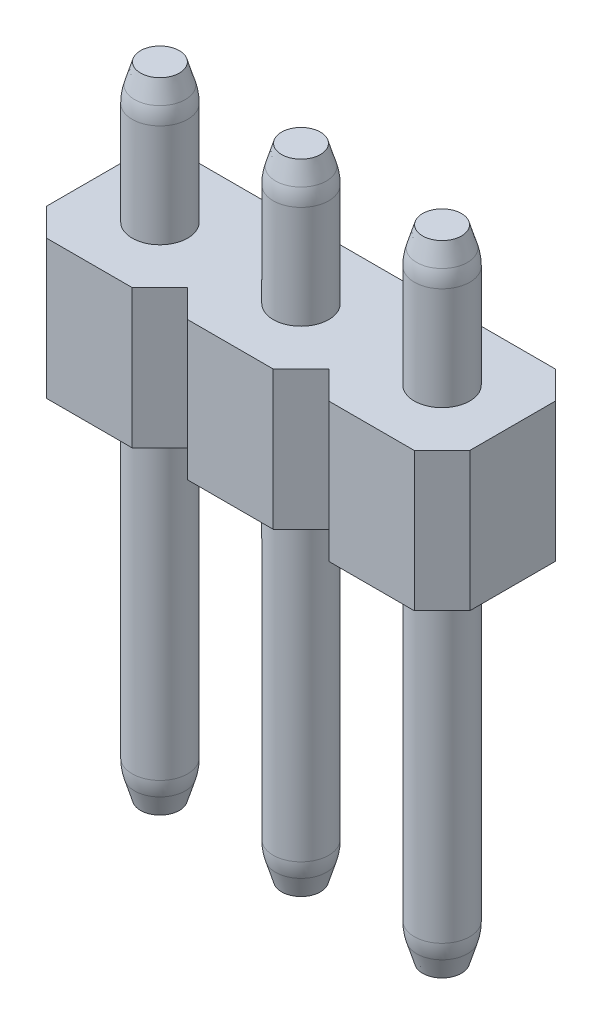
ISO-10303-21;
HEADER;
FILE_DESCRIPTION(('STEP AP214'),'2;1');
FILE_NAME('part.step','',(''),(''),'','','');
FILE_SCHEMA(('AUTOMOTIVE_DESIGN { 1 0 10303 214 1 1 1 1 }'));
ENDSEC;
DATA;
#1=APPLICATION_CONTEXT('core data for automotive mechanical design processes');
#2=APPLICATION_PROTOCOL_DEFINITION('international standard','automotive_design',2000,#1);
#3=PRODUCT_CONTEXT('',#1,'mechanical');
#4=PRODUCT('Part','Part','',(#3));
#5=PRODUCT_RELATED_PRODUCT_CATEGORY('part','',(#4));
#6=PRODUCT_DEFINITION_FORMATION('','',#4);
#7=PRODUCT_DEFINITION_CONTEXT('part definition',#1,'design');
#8=PRODUCT_DEFINITION('design','',#6,#7);
#9=PRODUCT_DEFINITION_SHAPE('','',#8);
#10=(LENGTH_UNIT() NAMED_UNIT(*) SI_UNIT(.MILLI.,.METRE.));
#11=(NAMED_UNIT(*) PLANE_ANGLE_UNIT() SI_UNIT($,.RADIAN.));
#12=(NAMED_UNIT(*) SI_UNIT($,.STERADIAN.) SOLID_ANGLE_UNIT());
#13=UNCERTAINTY_MEASURE_WITH_UNIT(LENGTH_MEASURE(1.E-05),#10,'distance_accuracy_value','');
#14=(GEOMETRIC_REPRESENTATION_CONTEXT(3) GLOBAL_UNCERTAINTY_ASSIGNED_CONTEXT((#13)) GLOBAL_UNIT_ASSIGNED_CONTEXT((#10,
#11,#12)) REPRESENTATION_CONTEXT('',''));
#15=CARTESIAN_POINT('',(0.,0.,0.));
#16=DIRECTION('',(0.,0.,1.));
#17=DIRECTION('',(1.,0.,0.));
#18=AXIS2_PLACEMENT_3D('',#15,#16,#17);
#19=CARTESIAN_POINT('',(24.13,9.,0.77));
#20=DIRECTION('',(0.707106781186547,0.,-0.707106781186548));
#21=DIRECTION('',(-0.707106781186548,0.,-0.707106781186547));
#22=AXIS2_PLACEMENT_3D('',#19,#20,#21);
#23=PLANE('',#22);
#24=DIRECTION('',(0.707106781186548,0.,0.707106781186547));
#25=VECTOR('',#24,1.);
#26=CARTESIAN_POINT('',(24.13,6.5,0.77));
#27=LINE('',#26,#25);
#28=CARTESIAN_POINT('',(24.13,6.5,0.77));
#29=VERTEX_POINT('',#28);
#30=CARTESIAN_POINT('',(24.63,6.5,1.27));
#31=VERTEX_POINT('',#30);
#32=EDGE_CURVE('E200',#29,#31,#27,.T.);
#33=ORIENTED_EDGE('',*,*,#32,.T.);
#34=DIRECTION('',(0.,-1.,0.));
#35=VECTOR('',#34,1.);
#36=CARTESIAN_POINT('',(24.63,9.,1.27));
#37=LINE('',#36,#35);
#38=CARTESIAN_POINT('',(24.63,9.,1.27));
#39=VERTEX_POINT('',#38);
#40=EDGE_CURVE('E280',#39,#31,#37,.T.);
#41=ORIENTED_EDGE('',*,*,#40,.F.);
#42=DIRECTION('',(0.707106781186548,0.,0.707106781186547));
#43=VECTOR('',#42,1.);
#44=CARTESIAN_POINT('',(24.13,9.,0.77));
#45=LINE('',#44,#43);
#46=CARTESIAN_POINT('',(24.13,9.,0.77));
#47=VERTEX_POINT('',#46);
#48=EDGE_CURVE('E131',#47,#39,#45,.T.);
#49=ORIENTED_EDGE('',*,*,#48,.F.);
#50=DIRECTION('',(0.,-1.,0.));
#51=VECTOR('',#50,1.);
#52=CARTESIAN_POINT('',(24.13,9.,0.77));
#53=LINE('',#52,#51);
#54=EDGE_CURVE('E283',#47,#29,#53,.T.);
#55=ORIENTED_EDGE('',*,*,#54,.T.);
#56=EDGE_LOOP('',(#33,#41,#49,#55));
#57=FACE_BOUND('',#56,.T.);
#58=ADVANCED_FACE('F40',(#57),#23,.F.);
#59=CARTESIAN_POINT('',(24.63,9.,1.27));
#60=DIRECTION('',(0.,0.,-1.));
#61=DIRECTION('',(-1.,0.,0.));
#62=AXIS2_PLACEMENT_3D('',#59,#60,#61);
#63=PLANE('',#62);
#64=DIRECTION('',(1.,0.,0.));
#65=VECTOR('',#64,1.);
#66=CARTESIAN_POINT('',(24.63,6.5,1.27));
#67=LINE('',#66,#65);
#68=CARTESIAN_POINT('',(26.17,6.5,1.27));
#69=VERTEX_POINT('',#68);
#70=EDGE_CURVE('E202',#31,#69,#67,.T.);
#71=ORIENTED_EDGE('',*,*,#70,.T.);
#72=DIRECTION('',(0.,-1.,0.));
#73=VECTOR('',#72,1.);
#74=CARTESIAN_POINT('',(26.17,9.,1.27));
#75=LINE('',#74,#73);
#76=CARTESIAN_POINT('',(26.17,9.,1.27));
#77=VERTEX_POINT('',#76);
#78=EDGE_CURVE('E277',#77,#69,#75,.T.);
#79=ORIENTED_EDGE('',*,*,#78,.F.);
#80=DIRECTION('',(1.,0.,0.));
#81=VECTOR('',#80,1.);
#82=CARTESIAN_POINT('',(24.63,9.,1.27));
#83=LINE('',#82,#81);
#84=EDGE_CURVE('E407',#39,#77,#83,.T.);
#85=ORIENTED_EDGE('',*,*,#84,.F.);
#86=ORIENTED_EDGE('',*,*,#40,.T.);
#87=EDGE_LOOP('',(#71,#79,#85,#86));
#88=FACE_BOUND('',#87,.T.);
#89=ADVANCED_FACE('F430',(#88),#63,.F.);
#90=CARTESIAN_POINT('',(26.17,9.,1.27));
#91=DIRECTION('',(-0.707106781186547,0.,-0.707106781186548));
#92=DIRECTION('',(-0.707106781186548,0.,0.707106781186547));
#93=AXIS2_PLACEMENT_3D('',#90,#91,#92);
#94=PLANE('',#93);
#95=DIRECTION('',(0.707106781186548,0.,-0.707106781186547));
#96=VECTOR('',#95,1.);
#97=CARTESIAN_POINT('',(26.17,6.5,1.27));
#98=LINE('',#97,#96);
#99=CARTESIAN_POINT('',(26.67,6.5,0.77));
#100=VERTEX_POINT('',#99);
#101=EDGE_CURVE('E205',#69,#100,#98,.T.);
#102=ORIENTED_EDGE('',*,*,#101,.T.);
#103=DIRECTION('',(0.,-1.,0.));
#104=VECTOR('',#103,1.);
#105=CARTESIAN_POINT('',(26.67,9.,0.77));
#106=LINE('',#105,#104);
#107=CARTESIAN_POINT('',(26.67,9.,0.77));
#108=VERTEX_POINT('',#107);
#109=EDGE_CURVE('E274',#108,#100,#106,.T.);
#110=ORIENTED_EDGE('',*,*,#109,.F.);
#111=DIRECTION('',(0.707106781186548,0.,-0.707106781186547));
#112=VECTOR('',#111,1.);
#113=CARTESIAN_POINT('',(26.17,9.,1.27));
#114=LINE('',#113,#112);
#115=EDGE_CURVE('E405',#77,#108,#114,.T.);
#116=ORIENTED_EDGE('',*,*,#115,.F.);
#117=ORIENTED_EDGE('',*,*,#78,.T.);
#118=EDGE_LOOP('',(#102,#110,#116,#117));
#119=FACE_BOUND('',#118,.T.);
#120=ADVANCED_FACE('F436',(#119),#94,.F.);
#121=CARTESIAN_POINT('',(26.67,9.,0.77));
#122=DIRECTION('',(0.707106781186547,0.,-0.707106781186548));
#123=DIRECTION('',(-0.707106781186548,0.,-0.707106781186547));
#124=AXIS2_PLACEMENT_3D('',#121,#122,#123);
#125=PLANE('',#124);
#126=DIRECTION('',(0.707106781186548,0.,0.707106781186547));
#127=VECTOR('',#126,1.);
#128=CARTESIAN_POINT('',(26.67,6.5,0.77));
#129=LINE('',#128,#127);
#130=CARTESIAN_POINT('',(27.17,6.5,1.27));
#131=VERTEX_POINT('',#130);
#132=EDGE_CURVE('E207',#100,#131,#129,.T.);
#133=ORIENTED_EDGE('',*,*,#132,.T.);
#134=DIRECTION('',(0.,-1.,0.));
#135=VECTOR('',#134,1.);
#136=CARTESIAN_POINT('',(27.17,9.,1.27));
#137=LINE('',#136,#135);
#138=CARTESIAN_POINT('',(27.17,9.,1.27));
#139=VERTEX_POINT('',#138);
#140=EDGE_CURVE('E271',#139,#131,#137,.T.);
#141=ORIENTED_EDGE('',*,*,#140,.F.);
#142=DIRECTION('',(0.707106781186548,0.,0.707106781186547));
#143=VECTOR('',#142,1.);
#144=CARTESIAN_POINT('',(26.67,9.,0.77));
#145=LINE('',#144,#143);
#146=EDGE_CURVE('E403',#108,#139,#145,.T.);
#147=ORIENTED_EDGE('',*,*,#146,.F.);
#148=ORIENTED_EDGE('',*,*,#109,.T.);
#149=EDGE_LOOP('',(#133,#141,#147,#148));
#150=FACE_BOUND('',#149,.T.);
#151=ADVANCED_FACE('F440',(#150),#125,.F.);
#152=CARTESIAN_POINT('',(27.17,9.,1.27));
#153=DIRECTION('',(0.,0.,-1.));
#154=DIRECTION('',(-1.,0.,0.));
#155=AXIS2_PLACEMENT_3D('',#152,#153,#154);
#156=PLANE('',#155);
#157=DIRECTION('',(1.,0.,0.));
#158=VECTOR('',#157,1.);
#159=CARTESIAN_POINT('',(27.17,6.5,1.27));
#160=LINE('',#159,#158);
#161=CARTESIAN_POINT('',(28.71,6.5,1.27));
#162=VERTEX_POINT('',#161);
#163=EDGE_CURVE('E209',#131,#162,#160,.T.);
#164=ORIENTED_EDGE('',*,*,#163,.T.);
#165=DIRECTION('',(0.,-1.,0.));
#166=VECTOR('',#165,1.);
#167=CARTESIAN_POINT('',(28.71,9.,1.27));
#168=LINE('',#167,#166);
#169=CARTESIAN_POINT('',(28.71,9.,1.27));
#170=VERTEX_POINT('',#169);
#171=EDGE_CURVE('E268',#170,#162,#168,.T.);
#172=ORIENTED_EDGE('',*,*,#171,.F.);
#173=DIRECTION('',(1.,0.,0.));
#174=VECTOR('',#173,1.);
#175=CARTESIAN_POINT('',(27.17,9.,1.27));
#176=LINE('',#175,#174);
#177=EDGE_CURVE('E401',#139,#170,#176,.T.);
#178=ORIENTED_EDGE('',*,*,#177,.F.);
#179=ORIENTED_EDGE('',*,*,#140,.T.);
#180=EDGE_LOOP('',(#164,#172,#178,#179));
#181=FACE_BOUND('',#180,.T.);
#182=ADVANCED_FACE('F445',(#181),#156,.F.);
#183=CARTESIAN_POINT('',(28.71,9.,1.27));
#184=DIRECTION('',(-0.707106781186547,0.,-0.707106781186548));
#185=DIRECTION('',(-0.707106781186548,0.,0.707106781186547));
#186=AXIS2_PLACEMENT_3D('',#183,#184,#185);
#187=PLANE('',#186);
#188=DIRECTION('',(0.707106781186548,0.,-0.707106781186547));
#189=VECTOR('',#188,1.);
#190=CARTESIAN_POINT('',(28.71,6.5,1.27));
#191=LINE('',#190,#189);
#192=CARTESIAN_POINT('',(29.21,6.5,0.77));
#193=VERTEX_POINT('',#192);
#194=EDGE_CURVE('E211',#162,#193,#191,.T.);
#195=ORIENTED_EDGE('',*,*,#194,.T.);
#196=DIRECTION('',(0.,-1.,0.));
#197=VECTOR('',#196,1.);
#198=CARTESIAN_POINT('',(29.21,9.,0.77));
#199=LINE('',#198,#197);
#200=CARTESIAN_POINT('',(29.21,9.,0.77));
#201=VERTEX_POINT('',#200);
#202=EDGE_CURVE('E265',#201,#193,#199,.T.);
#203=ORIENTED_EDGE('',*,*,#202,.F.);
#204=DIRECTION('',(0.707106781186548,0.,-0.707106781186547));
#205=VECTOR('',#204,1.);
#206=CARTESIAN_POINT('',(28.71,9.,1.27));
#207=LINE('',#206,#205);
#208=EDGE_CURVE('E399',#170,#201,#207,.T.);
#209=ORIENTED_EDGE('',*,*,#208,.F.);
#210=ORIENTED_EDGE('',*,*,#171,.T.);
#211=EDGE_LOOP('',(#195,#203,#209,#210));
#212=FACE_BOUND('',#211,.T.);
#213=ADVANCED_FACE('F451',(#212),#187,.F.);
#214=CARTESIAN_POINT('',(29.21,9.,0.77));
#215=DIRECTION('',(0.70710678118655,0.,-0.707106781186545));
#216=DIRECTION('',(-0.707106781186545,0.,-0.70710678118655));
#217=AXIS2_PLACEMENT_3D('',#214,#215,#216);
#218=PLANE('',#217);
#219=DIRECTION('',(0.707106781186545,0.,0.70710678118655));
#220=VECTOR('',#219,1.);
#221=CARTESIAN_POINT('',(29.21,6.5,0.77));
#222=LINE('',#221,#220);
#223=CARTESIAN_POINT('',(29.71,6.5,1.27));
#224=VERTEX_POINT('',#223);
#225=EDGE_CURVE('E213',#193,#224,#222,.T.);
#226=ORIENTED_EDGE('',*,*,#225,.T.);
#227=DIRECTION('',(0.,-1.,0.));
#228=VECTOR('',#227,1.);
#229=CARTESIAN_POINT('',(29.71,9.,1.27));
#230=LINE('',#229,#228);
#231=CARTESIAN_POINT('',(29.71,9.,1.27));
#232=VERTEX_POINT('',#231);
#233=EDGE_CURVE('E262',#232,#224,#230,.T.);
#234=ORIENTED_EDGE('',*,*,#233,.F.);
#235=DIRECTION('',(0.707106781186545,0.,0.70710678118655));
#236=VECTOR('',#235,1.);
#237=CARTESIAN_POINT('',(29.21,9.,0.77));
#238=LINE('',#237,#236);
#239=EDGE_CURVE('E397',#201,#232,#238,.T.);
#240=ORIENTED_EDGE('',*,*,#239,.F.);
#241=ORIENTED_EDGE('',*,*,#202,.T.);
#242=EDGE_LOOP('',(#226,#234,#240,#241));
#243=FACE_BOUND('',#242,.T.);
#244=ADVANCED_FACE('F455',(#243),#218,.F.);
#245=CARTESIAN_POINT('',(29.71,9.,1.27));
#246=DIRECTION('',(0.,0.,-1.));
#247=DIRECTION('',(-1.,0.,0.));
#248=AXIS2_PLACEMENT_3D('',#245,#246,#247);
#249=PLANE('',#248);
#250=DIRECTION('',(1.,0.,0.));
#251=VECTOR('',#250,1.);
#252=CARTESIAN_POINT('',(29.71,6.5,1.27));
#253=LINE('',#252,#251);
#254=CARTESIAN_POINT('',(31.25,6.5,1.27));
#255=VERTEX_POINT('',#254);
#256=EDGE_CURVE('E215',#224,#255,#253,.T.);
#257=ORIENTED_EDGE('',*,*,#256,.T.);
#258=DIRECTION('',(0.,-1.,0.));
#259=VECTOR('',#258,1.);
#260=CARTESIAN_POINT('',(31.25,9.,1.27));
#261=LINE('',#260,#259);
#262=CARTESIAN_POINT('',(31.25,9.,1.27));
#263=VERTEX_POINT('',#262);
#264=EDGE_CURVE('E259',#263,#255,#261,.T.);
#265=ORIENTED_EDGE('',*,*,#264,.F.);
#266=DIRECTION('',(1.,0.,0.));
#267=VECTOR('',#266,1.);
#268=CARTESIAN_POINT('',(29.71,9.,1.27));
#269=LINE('',#268,#267);
#270=EDGE_CURVE('E395',#232,#263,#269,.T.);
#271=ORIENTED_EDGE('',*,*,#270,.F.);
#272=ORIENTED_EDGE('',*,*,#233,.T.);
#273=EDGE_LOOP('',(#257,#265,#271,#272));
#274=FACE_BOUND('',#273,.T.);
#275=ADVANCED_FACE('F460',(#274),#249,.F.);
#276=CARTESIAN_POINT('',(31.25,9.,1.27));
#277=DIRECTION('',(-0.707106781186547,0.,-0.707106781186548));
#278=DIRECTION('',(-0.707106781186548,0.,0.707106781186547));
#279=AXIS2_PLACEMENT_3D('',#276,#277,#278);
#280=PLANE('',#279);
#281=DIRECTION('',(0.707106781186548,0.,-0.707106781186547));
#282=VECTOR('',#281,1.);
#283=CARTESIAN_POINT('',(31.25,6.5,1.27));
#284=LINE('',#283,#282);
#285=CARTESIAN_POINT('',(31.75,6.5,0.77));
#286=VERTEX_POINT('',#285);
#287=EDGE_CURVE('E217',#255,#286,#284,.T.);
#288=ORIENTED_EDGE('',*,*,#287,.T.);
#289=DIRECTION('',(0.,-1.,0.));
#290=VECTOR('',#289,1.);
#291=CARTESIAN_POINT('',(31.75,9.,0.77));
#292=LINE('',#291,#290);
#293=CARTESIAN_POINT('',(31.75,9.,0.77));
#294=VERTEX_POINT('',#293);
#295=EDGE_CURVE('E257',#294,#286,#292,.T.);
#296=ORIENTED_EDGE('',*,*,#295,.F.);
#297=DIRECTION('',(0.707106781186548,0.,-0.707106781186547));
#298=VECTOR('',#297,1.);
#299=CARTESIAN_POINT('',(31.25,9.,1.27));
#300=LINE('',#299,#298);
#301=EDGE_CURVE('E392',#263,#294,#300,.T.);
#302=ORIENTED_EDGE('',*,*,#301,.F.);
#303=ORIENTED_EDGE('',*,*,#264,.T.);
#304=EDGE_LOOP('',(#288,#296,#302,#303));
#305=FACE_BOUND('',#304,.T.);
#306=ADVANCED_FACE('F463',(#305),#280,.F.);
#307=CARTESIAN_POINT('',(31.25,9.,-1.27));
#308=DIRECTION('',(-0.707106781186547,0.,0.707106781186548));
#309=DIRECTION('',(0.707106781186548,0.,0.707106781186547));
#310=AXIS2_PLACEMENT_3D('',#307,#308,#309);
#311=PLANE('',#310);
#312=DIRECTION('',(-0.707106781186548,0.,-0.707106781186547));
#313=VECTOR('',#312,1.);
#314=CARTESIAN_POINT('',(31.25,6.5,-1.27));
#315=LINE('',#314,#313);
#316=CARTESIAN_POINT('',(31.75,6.5,-0.77));
#317=VERTEX_POINT('',#316);
#318=CARTESIAN_POINT('',(31.25,6.5,-1.27));
#319=VERTEX_POINT('',#318);
#320=EDGE_CURVE('E220',#317,#319,#315,.T.);
#321=ORIENTED_EDGE('',*,*,#320,.T.);
#322=DIRECTION('',(0.,-1.,0.));
#323=VECTOR('',#322,1.);
#324=CARTESIAN_POINT('',(31.25,9.,-1.27));
#325=LINE('',#324,#323);
#326=CARTESIAN_POINT('',(31.25,9.,-1.27));
#327=VERTEX_POINT('',#326);
#328=EDGE_CURVE('E251',#327,#319,#325,.T.);
#329=ORIENTED_EDGE('',*,*,#328,.F.);
#330=DIRECTION('',(-0.707106781186548,0.,-0.707106781186547));
#331=VECTOR('',#330,1.);
#332=CARTESIAN_POINT('',(31.25,9.,-1.27));
#333=LINE('',#332,#331);
#334=CARTESIAN_POINT('',(31.75,9.,-0.77));
#335=VERTEX_POINT('',#334);
#336=EDGE_CURVE('E369',#335,#327,#333,.T.);
#337=ORIENTED_EDGE('',*,*,#336,.F.);
#338=DIRECTION('',(0.,-1.,0.));
#339=VECTOR('',#338,1.);
#340=CARTESIAN_POINT('',(31.75,9.,-0.77));
#341=LINE('',#340,#339);
#342=EDGE_CURVE('E254',#335,#317,#341,.T.);
#343=ORIENTED_EDGE('',*,*,#342,.T.);
#344=EDGE_LOOP('',(#321,#329,#337,#343));
#345=FACE_BOUND('',#344,.T.);
#346=ADVANCED_FACE('F367',(#345),#311,.F.);
#347=CARTESIAN_POINT('',(29.71,9.,-1.27));
#348=DIRECTION('',(0.,0.,1.));
#349=DIRECTION('',(1.,0.,0.));
#350=AXIS2_PLACEMENT_3D('',#347,#348,#349);
#351=PLANE('',#350);
#352=DIRECTION('',(-1.,0.,0.));
#353=VECTOR('',#352,1.);
#354=CARTESIAN_POINT('',(29.71,6.5,-1.27));
#355=LINE('',#354,#353);
#356=CARTESIAN_POINT('',(29.71,6.5,-1.27));
#357=VERTEX_POINT('',#356);
#358=EDGE_CURVE('E222',#319,#357,#355,.T.);
#359=ORIENTED_EDGE('',*,*,#358,.T.);
#360=DIRECTION('',(0.,-1.,0.));
#361=VECTOR('',#360,1.);
#362=CARTESIAN_POINT('',(29.71,9.,-1.27));
#363=LINE('',#362,#361);
#364=CARTESIAN_POINT('',(29.71,9.,-1.27));
#365=VERTEX_POINT('',#364);
#366=EDGE_CURVE('E248',#365,#357,#363,.T.);
#367=ORIENTED_EDGE('',*,*,#366,.F.);
#368=DIRECTION('',(-1.,0.,0.));
#369=VECTOR('',#368,1.);
#370=CARTESIAN_POINT('',(29.71,9.,-1.27));
#371=LINE('',#370,#369);
#372=EDGE_CURVE('E386',#327,#365,#371,.T.);
#373=ORIENTED_EDGE('',*,*,#372,.F.);
#374=ORIENTED_EDGE('',*,*,#328,.T.);
#375=EDGE_LOOP('',(#359,#367,#373,#374));
#376=FACE_BOUND('',#375,.T.);
#377=ADVANCED_FACE('F377',(#376),#351,.F.);
#378=CARTESIAN_POINT('',(29.21,9.,-0.77));
#379=DIRECTION('',(0.70710678118655,0.,0.707106781186545));
#380=DIRECTION('',(0.707106781186545,0.,-0.70710678118655));
#381=AXIS2_PLACEMENT_3D('',#378,#379,#380);
#382=PLANE('',#381);
#383=DIRECTION('',(-0.707106781186545,0.,0.70710678118655));
#384=VECTOR('',#383,1.);
#385=CARTESIAN_POINT('',(29.21,6.5,-0.77));
#386=LINE('',#385,#384);
#387=CARTESIAN_POINT('',(29.21,6.5,-0.77));
#388=VERTEX_POINT('',#387);
#389=EDGE_CURVE('E224',#357,#388,#386,.T.);
#390=ORIENTED_EDGE('',*,*,#389,.T.);
#391=DIRECTION('',(0.,-1.,0.));
#392=VECTOR('',#391,1.);
#393=CARTESIAN_POINT('',(29.21,9.,-0.77));
#394=LINE('',#393,#392);
#395=CARTESIAN_POINT('',(29.21,9.,-0.77));
#396=VERTEX_POINT('',#395);
#397=EDGE_CURVE('E245',#396,#388,#394,.T.);
#398=ORIENTED_EDGE('',*,*,#397,.F.);
#399=DIRECTION('',(-0.707106781186545,0.,0.70710678118655));
#400=VECTOR('',#399,1.);
#401=CARTESIAN_POINT('',(29.21,9.,-0.77));
#402=LINE('',#401,#400);
#403=EDGE_CURVE('E383',#365,#396,#402,.T.);
#404=ORIENTED_EDGE('',*,*,#403,.F.);
#405=ORIENTED_EDGE('',*,*,#366,.T.);
#406=EDGE_LOOP('',(#390,#398,#404,#405));
#407=FACE_BOUND('',#406,.T.);
#408=ADVANCED_FACE('F381',(#407),#382,.F.);
#409=CARTESIAN_POINT('',(28.71,9.,-1.27));
#410=DIRECTION('',(-0.707106781186547,0.,0.707106781186548));
#411=DIRECTION('',(0.707106781186548,0.,0.707106781186547));
#412=AXIS2_PLACEMENT_3D('',#409,#410,#411);
#413=PLANE('',#412);
#414=DIRECTION('',(-0.707106781186548,0.,-0.707106781186547));
#415=VECTOR('',#414,1.);
#416=CARTESIAN_POINT('',(28.71,6.5,-1.27));
#417=LINE('',#416,#415);
#418=CARTESIAN_POINT('',(28.71,6.5,-1.27));
#419=VERTEX_POINT('',#418);
#420=EDGE_CURVE('E226',#388,#419,#417,.T.);
#421=ORIENTED_EDGE('',*,*,#420,.T.);
#422=DIRECTION('',(0.,-1.,0.));
#423=VECTOR('',#422,1.);
#424=CARTESIAN_POINT('',(28.71,9.,-1.27));
#425=LINE('',#424,#423);
#426=CARTESIAN_POINT('',(28.71,9.,-1.27));
#427=VERTEX_POINT('',#426);
#428=EDGE_CURVE('E242',#427,#419,#425,.T.);
#429=ORIENTED_EDGE('',*,*,#428,.F.);
#430=DIRECTION('',(-0.707106781186548,0.,-0.707106781186547));
#431=VECTOR('',#430,1.);
#432=CARTESIAN_POINT('',(28.71,9.,-1.27));
#433=LINE('',#432,#431);
#434=EDGE_CURVE('E385',#396,#427,#433,.T.);
#435=ORIENTED_EDGE('',*,*,#434,.F.);
#436=ORIENTED_EDGE('',*,*,#397,.T.);
#437=EDGE_LOOP('',(#421,#429,#435,#436));
#438=FACE_BOUND('',#437,.T.);
#439=ADVANCED_FACE('F579',(#438),#413,.F.);
#440=CARTESIAN_POINT('',(27.17,9.,-1.27));
#441=DIRECTION('',(0.,0.,1.));
#442=DIRECTION('',(1.,0.,0.));
#443=AXIS2_PLACEMENT_3D('',#440,#441,#442);
#444=PLANE('',#443);
#445=DIRECTION('',(-1.,0.,0.));
#446=VECTOR('',#445,1.);
#447=CARTESIAN_POINT('',(27.17,6.5,-1.27));
#448=LINE('',#447,#446);
#449=CARTESIAN_POINT('',(27.17,6.5,-1.27));
#450=VERTEX_POINT('',#449);
#451=EDGE_CURVE('E228',#419,#450,#448,.T.);
#452=ORIENTED_EDGE('',*,*,#451,.T.);
#453=DIRECTION('',(0.,-1.,0.));
#454=VECTOR('',#453,1.);
#455=CARTESIAN_POINT('',(27.17,9.,-1.27));
#456=LINE('',#455,#454);
#457=CARTESIAN_POINT('',(27.17,9.,-1.27));
#458=VERTEX_POINT('',#457);
#459=EDGE_CURVE('E190',#458,#450,#456,.T.);
#460=ORIENTED_EDGE('',*,*,#459,.F.);
#461=DIRECTION('',(-1.,0.,0.));
#462=VECTOR('',#461,1.);
#463=CARTESIAN_POINT('',(27.17,9.,-1.27));
#464=LINE('',#463,#462);
#465=EDGE_CURVE('E178',#427,#458,#464,.T.);
#466=ORIENTED_EDGE('',*,*,#465,.F.);
#467=ORIENTED_EDGE('',*,*,#428,.T.);
#468=EDGE_LOOP('',(#452,#460,#466,#467));
#469=FACE_BOUND('',#468,.T.);
#470=ADVANCED_FACE('F576',(#469),#444,.F.);
#471=CARTESIAN_POINT('',(26.67,9.,-0.77));
#472=DIRECTION('',(0.707106781186547,0.,0.707106781186548));
#473=DIRECTION('',(0.707106781186548,0.,-0.707106781186547));
#474=AXIS2_PLACEMENT_3D('',#471,#472,#473);
#475=PLANE('',#474);
#476=DIRECTION('',(-0.707106781186548,0.,0.707106781186547));
#477=VECTOR('',#476,1.);
#478=CARTESIAN_POINT('',(26.67,6.5,-0.77));
#479=LINE('',#478,#477);
#480=CARTESIAN_POINT('',(26.67,6.5,-0.77));
#481=VERTEX_POINT('',#480);
#482=EDGE_CURVE('E187',#450,#481,#479,.T.);
#483=ORIENTED_EDGE('',*,*,#482,.T.);
#484=DIRECTION('',(0.,-1.,0.));
#485=VECTOR('',#484,1.);
#486=CARTESIAN_POINT('',(26.67,9.,-0.77));
#487=LINE('',#486,#485);
#488=CARTESIAN_POINT('',(26.67,9.,-0.77));
#489=VERTEX_POINT('',#488);
#490=EDGE_CURVE('E184',#489,#481,#487,.T.);
#491=ORIENTED_EDGE('',*,*,#490,.F.);
#492=DIRECTION('',(-0.707106781186548,0.,0.707106781186547));
#493=VECTOR('',#492,1.);
#494=CARTESIAN_POINT('',(26.67,9.,-0.77));
#495=LINE('',#494,#493);
#496=EDGE_CURVE('E171',#458,#489,#495,.T.);
#497=ORIENTED_EDGE('',*,*,#496,.F.);
#498=ORIENTED_EDGE('',*,*,#459,.T.);
#499=EDGE_LOOP('',(#483,#491,#497,#498));
#500=FACE_BOUND('',#499,.T.);
#501=ADVANCED_FACE('F185',(#500),#475,.F.);
#502=CARTESIAN_POINT('',(26.17,9.,-1.27));
#503=DIRECTION('',(-0.707106781186547,0.,0.707106781186548));
#504=DIRECTION('',(0.707106781186548,0.,0.707106781186547));
#505=AXIS2_PLACEMENT_3D('',#502,#503,#504);
#506=PLANE('',#505);
#507=DIRECTION('',(-0.707106781186548,0.,-0.707106781186547));
#508=VECTOR('',#507,1.);
#509=CARTESIAN_POINT('',(26.17,6.5,-1.27));
#510=LINE('',#509,#508);
#511=CARTESIAN_POINT('',(26.17,6.5,-1.27));
#512=VERTEX_POINT('',#511);
#513=EDGE_CURVE('E231',#481,#512,#510,.T.);
#514=ORIENTED_EDGE('',*,*,#513,.T.);
#515=DIRECTION('',(0.,-1.,0.));
#516=VECTOR('',#515,1.);
#517=CARTESIAN_POINT('',(26.17,9.,-1.27));
#518=LINE('',#517,#516);
#519=CARTESIAN_POINT('',(26.17,9.,-1.27));
#520=VERTEX_POINT('',#519);
#521=EDGE_CURVE('E191',#520,#512,#518,.T.);
#522=ORIENTED_EDGE('',*,*,#521,.F.);
#523=DIRECTION('',(-0.707106781186548,0.,-0.707106781186547));
#524=VECTOR('',#523,1.);
#525=CARTESIAN_POINT('',(26.17,9.,-1.27));
#526=LINE('',#525,#524);
#527=EDGE_CURVE('E175',#489,#520,#526,.T.);
#528=ORIENTED_EDGE('',*,*,#527,.F.);
#529=ORIENTED_EDGE('',*,*,#490,.T.);
#530=EDGE_LOOP('',(#514,#522,#528,#529));
#531=FACE_BOUND('',#530,.T.);
#532=ADVANCED_FACE('F193',(#531),#506,.F.);
#533=CARTESIAN_POINT('',(24.63,9.,-1.27));
#534=DIRECTION('',(0.,0.,1.));
#535=DIRECTION('',(1.,0.,0.));
#536=AXIS2_PLACEMENT_3D('',#533,#534,#535);
#537=PLANE('',#536);
#538=DIRECTION('',(-1.,0.,0.));
#539=VECTOR('',#538,1.);
#540=CARTESIAN_POINT('',(24.63,6.5,-1.27));
#541=LINE('',#540,#539);
#542=CARTESIAN_POINT('',(24.63,6.5,-1.27));
#543=VERTEX_POINT('',#542);
#544=EDGE_CURVE('E116',#512,#543,#541,.T.);
#545=ORIENTED_EDGE('',*,*,#544,.T.);
#546=DIRECTION('',(0.,-1.,0.));
#547=VECTOR('',#546,1.);
#548=CARTESIAN_POINT('',(24.63,9.,-1.27));
#549=LINE('',#548,#547);
#550=CARTESIAN_POINT('',(24.63,9.,-1.27));
#551=VERTEX_POINT('',#550);
#552=EDGE_CURVE('E238',#551,#543,#549,.T.);
#553=ORIENTED_EDGE('',*,*,#552,.F.);
#554=DIRECTION('',(-1.,0.,0.));
#555=VECTOR('',#554,1.);
#556=CARTESIAN_POINT('',(24.63,9.,-1.27));
#557=LINE('',#556,#555);
#558=EDGE_CURVE('E57',#520,#551,#557,.T.);
#559=ORIENTED_EDGE('',*,*,#558,.F.);
#560=ORIENTED_EDGE('',*,*,#521,.T.);
#561=EDGE_LOOP('',(#545,#553,#559,#560));
#562=FACE_BOUND('',#561,.T.);
#563=ADVANCED_FACE('F568',(#562),#537,.F.);
#564=CARTESIAN_POINT('',(24.13,9.,-0.77));
#565=DIRECTION('',(0.707106781186547,0.,0.707106781186548));
#566=DIRECTION('',(0.707106781186548,0.,-0.707106781186547));
#567=AXIS2_PLACEMENT_3D('',#564,#565,#566);
#568=PLANE('',#567);
#569=DIRECTION('',(-0.707106781186548,0.,0.707106781186547));
#570=VECTOR('',#569,1.);
#571=CARTESIAN_POINT('',(24.13,6.5,-0.77));
#572=LINE('',#571,#570);
#573=CARTESIAN_POINT('',(24.13,6.5,-0.77));
#574=VERTEX_POINT('',#573);
#575=EDGE_CURVE('E234',#543,#574,#572,.T.);
#576=ORIENTED_EDGE('',*,*,#575,.T.);
#577=DIRECTION('',(0.,-1.,0.));
#578=VECTOR('',#577,1.);
#579=CARTESIAN_POINT('',(24.13,9.,-0.77));
#580=LINE('',#579,#578);
#581=CARTESIAN_POINT('',(24.13,9.,-0.77));
#582=VERTEX_POINT('',#581);
#583=EDGE_CURVE('E123',#582,#574,#580,.T.);
#584=ORIENTED_EDGE('',*,*,#583,.F.);
#585=DIRECTION('',(-0.707106781186548,0.,0.707106781186547));
#586=VECTOR('',#585,1.);
#587=CARTESIAN_POINT('',(24.13,9.,-0.77));
#588=LINE('',#587,#586);
#589=EDGE_CURVE('E195',#551,#582,#588,.T.);
#590=ORIENTED_EDGE('',*,*,#589,.F.);
#591=ORIENTED_EDGE('',*,*,#552,.T.);
#592=EDGE_LOOP('',(#576,#584,#590,#591));
#593=FACE_BOUND('',#592,.T.);
#594=ADVANCED_FACE('F563',(#593),#568,.F.);
#595=CARTESIAN_POINT('',(0.,9.,0.));
#596=DIRECTION('',(0.,-1.,0.));
#597=DIRECTION('',(0.,0.,-1.));
#598=AXIS2_PLACEMENT_3D('',#595,#596,#597);
#599=PLANE('',#598);
#600=CARTESIAN_POINT('',(30.48,9.,0.));
#601=DIRECTION('',(0.,-1.,0.));
#602=DIRECTION('',(0.,0.,-1.));
#603=AXIS2_PLACEMENT_3D('',#600,#601,#602);
#604=CIRCLE('',#603,0.499999999999999);
#605=CARTESIAN_POINT('',(30.48,9.,-0.499999999999999));
#606=VERTEX_POINT('',#605);
#607=EDGE_CURVE('E300',#606,#606,#604,.F.);
#608=ORIENTED_EDGE('',*,*,#607,.F.);
#609=EDGE_LOOP('',(#608));
#610=FACE_BOUND('',#609,.T.);
#611=CARTESIAN_POINT('',(27.94,9.,0.));
#612=DIRECTION('',(0.,-1.,0.));
#613=DIRECTION('',(0.,0.,-1.));
#614=AXIS2_PLACEMENT_3D('',#611,#612,#613);
#615=CIRCLE('',#614,0.499999999999999);
#616=CARTESIAN_POINT('',(27.94,9.,-0.499999999999999));
#617=VERTEX_POINT('',#616);
#618=EDGE_CURVE('E412',#617,#617,#615,.F.);
#619=ORIENTED_EDGE('',*,*,#618,.F.);
#620=EDGE_LOOP('',(#619));
#621=FACE_BOUND('',#620,.T.);
#622=CARTESIAN_POINT('',(25.4,9.,0.));
#623=DIRECTION('',(0.,-1.,0.));
#624=DIRECTION('',(0.,0.,-1.));
#625=AXIS2_PLACEMENT_3D('',#622,#623,#624);
#626=CIRCLE('',#625,0.499999999999999);
#627=CARTESIAN_POINT('',(25.4,9.,-0.499999999999999));
#628=VERTEX_POINT('',#627);
#629=EDGE_CURVE('E286',#628,#628,#626,.F.);
#630=ORIENTED_EDGE('',*,*,#629,.F.);
#631=EDGE_LOOP('',(#630));
#632=FACE_BOUND('',#631,.T.);
#633=ORIENTED_EDGE('',*,*,#589,.T.);
#634=DIRECTION('',(0.,0.,1.));
#635=VECTOR('',#634,1.);
#636=CARTESIAN_POINT('',(24.13,9.,0.));
#637=LINE('',#636,#635);
#638=EDGE_CURVE('E418',#582,#47,#637,.T.);
#639=ORIENTED_EDGE('',*,*,#638,.T.);
#640=ORIENTED_EDGE('',*,*,#48,.T.);
#641=ORIENTED_EDGE('',*,*,#84,.T.);
#642=ORIENTED_EDGE('',*,*,#115,.T.);
#643=ORIENTED_EDGE('',*,*,#146,.T.);
#644=ORIENTED_EDGE('',*,*,#177,.T.);
#645=ORIENTED_EDGE('',*,*,#208,.T.);
#646=ORIENTED_EDGE('',*,*,#239,.T.);
#647=ORIENTED_EDGE('',*,*,#270,.T.);
#648=ORIENTED_EDGE('',*,*,#301,.T.);
#649=DIRECTION('',(0.,0.,-1.));
#650=VECTOR('',#649,1.);
#651=CARTESIAN_POINT('',(31.75,9.,0.));
#652=LINE('',#651,#650);
#653=EDGE_CURVE('E295',#294,#335,#652,.T.);
#654=ORIENTED_EDGE('',*,*,#653,.T.);
#655=ORIENTED_EDGE('',*,*,#336,.T.);
#656=ORIENTED_EDGE('',*,*,#372,.T.);
#657=ORIENTED_EDGE('',*,*,#403,.T.);
#658=ORIENTED_EDGE('',*,*,#434,.T.);
#659=ORIENTED_EDGE('',*,*,#465,.T.);
#660=ORIENTED_EDGE('',*,*,#496,.T.);
#661=ORIENTED_EDGE('',*,*,#527,.T.);
#662=ORIENTED_EDGE('',*,*,#558,.T.);
#663=EDGE_LOOP('',(#633,#639,#640,#641,#642,#643,#644,#645,#646,#647,#648,#654,#655,#656,#657,
#658,#659,#660,#661,#662));
#664=FACE_BOUND('',#663,.T.);
#665=ADVANCED_FACE('F173',(#610,#621,#632,#664),#599,.F.);
#666=CARTESIAN_POINT('',(0.,6.5,0.));
#667=DIRECTION('',(0.,-1.,0.));
#668=DIRECTION('',(0.,0.,-1.));
#669=AXIS2_PLACEMENT_3D('',#666,#667,#668);
#670=PLANE('',#669);
#671=DIRECTION('',(0.,0.,1.));
#672=VECTOR('',#671,1.);
#673=CARTESIAN_POINT('',(24.13,6.5,0.));
#674=LINE('',#673,#672);
#675=EDGE_CURVE('E11',#574,#29,#674,.T.);
#676=ORIENTED_EDGE('',*,*,#675,.F.);
#677=ORIENTED_EDGE('',*,*,#575,.F.);
#678=ORIENTED_EDGE('',*,*,#544,.F.);
#679=ORIENTED_EDGE('',*,*,#513,.F.);
#680=ORIENTED_EDGE('',*,*,#482,.F.);
#681=ORIENTED_EDGE('',*,*,#451,.F.);
#682=ORIENTED_EDGE('',*,*,#420,.F.);
#683=ORIENTED_EDGE('',*,*,#389,.F.);
#684=ORIENTED_EDGE('',*,*,#358,.F.);
#685=ORIENTED_EDGE('',*,*,#320,.F.);
#686=DIRECTION('',(0.,0.,-1.));
#687=VECTOR('',#686,1.);
#688=CARTESIAN_POINT('',(31.75,6.5,0.));
#689=LINE('',#688,#687);
#690=EDGE_CURVE('E49',#286,#317,#689,.T.);
#691=ORIENTED_EDGE('',*,*,#690,.F.);
#692=ORIENTED_EDGE('',*,*,#287,.F.);
#693=ORIENTED_EDGE('',*,*,#256,.F.);
#694=ORIENTED_EDGE('',*,*,#225,.F.);
#695=ORIENTED_EDGE('',*,*,#194,.F.);
#696=ORIENTED_EDGE('',*,*,#163,.F.);
#697=ORIENTED_EDGE('',*,*,#132,.F.);
#698=ORIENTED_EDGE('',*,*,#101,.F.);
#699=ORIENTED_EDGE('',*,*,#70,.F.);
#700=ORIENTED_EDGE('',*,*,#32,.F.);
#701=EDGE_LOOP('',(#676,#677,#678,#679,#680,#681,#682,#683,#684,#685,#691,#692,#693,#694,#695,
#696,#697,#698,#699,#700));
#702=FACE_BOUND('',#701,.T.);
#703=CARTESIAN_POINT('',(30.48,6.5,0.));
#704=DIRECTION('',(0.,-1.,0.));
#705=DIRECTION('',(0.,0.,-1.));
#706=AXIS2_PLACEMENT_3D('',#703,#704,#705);
#707=CIRCLE('',#706,0.499999999999999);
#708=CARTESIAN_POINT('',(30.48,6.5,-0.499999999999999));
#709=VERTEX_POINT('',#708);
#710=EDGE_CURVE('E292',#709,#709,#707,.F.);
#711=ORIENTED_EDGE('',*,*,#710,.T.);
#712=EDGE_LOOP('',(#711));
#713=FACE_BOUND('',#712,.T.);
#714=CARTESIAN_POINT('',(27.94,6.5,0.));
#715=DIRECTION('',(0.,-1.,0.));
#716=DIRECTION('',(0.,0.,-1.));
#717=AXIS2_PLACEMENT_3D('',#714,#715,#716);
#718=CIRCLE('',#717,0.499999999999999);
#719=CARTESIAN_POINT('',(27.94,6.5,-0.499999999999999));
#720=VERTEX_POINT('',#719);
#721=EDGE_CURVE('E289',#720,#720,#718,.F.);
#722=ORIENTED_EDGE('',*,*,#721,.T.);
#723=EDGE_LOOP('',(#722));
#724=FACE_BOUND('',#723,.T.);
#725=CARTESIAN_POINT('',(25.4,6.5,0.));
#726=DIRECTION('',(0.,-1.,0.));
#727=DIRECTION('',(0.,0.,-1.));
#728=AXIS2_PLACEMENT_3D('',#725,#726,#727);
#729=CIRCLE('',#728,0.499999999999999);
#730=CARTESIAN_POINT('',(25.4,6.5,-0.499999999999999));
#731=VERTEX_POINT('',#730);
#732=EDGE_CURVE('E203',#731,#731,#729,.F.);
#733=ORIENTED_EDGE('',*,*,#732,.T.);
#734=EDGE_LOOP('',(#733));
#735=FACE_BOUND('',#734,.T.);
#736=ADVANCED_FACE('F371',(#702,#713,#724,#735),#670,.T.);
#737=CARTESIAN_POINT('',(25.4,0.,0.));
#738=DIRECTION('',(0.,1.,0.));
#739=DIRECTION('',(0.,0.,1.));
#740=AXIS2_PLACEMENT_3D('',#737,#738,#739);
#741=PLANE('',#740);
#742=CARTESIAN_POINT('',(25.4,0.,0.));
#743=DIRECTION('',(0.,1.,0.));
#744=DIRECTION('',(0.,0.,1.));
#745=AXIS2_PLACEMENT_3D('',#742,#743,#744);
#746=CIRCLE('',#745,0.349999999999994);
#747=CARTESIAN_POINT('',(25.4,0.,0.349999999999994));
#748=VERTEX_POINT('',#747);
#749=EDGE_CURVE('E330',#748,#748,#746,.F.);
#750=ORIENTED_EDGE('',*,*,#749,.T.);
#751=EDGE_LOOP('',(#750));
#752=FACE_BOUND('',#751,.T.);
#753=ADVANCED_FACE('F543',(#752),#741,.F.);
#754=CARTESIAN_POINT('',(25.4,11.5,0.));
#755=DIRECTION('',(0.,-1.,0.));
#756=DIRECTION('',(0.,0.,-1.));
#757=AXIS2_PLACEMENT_3D('',#754,#755,#756);
#758=CYLINDRICAL_SURFACE('',#757,0.499999999999999);
#759=CARTESIAN_POINT('',(25.4,0.646768836303534,0.));
#760=DIRECTION('',(0.,-1.,0.));
#761=DIRECTION('',(0.,0.,-1.));
#762=AXIS2_PLACEMENT_3D('',#759,#760,#761);
#763=CIRCLE('',#762,0.499999999999999);
#764=CARTESIAN_POINT('',(25.4,0.646768836303534,-0.499999999999999));
#765=VERTEX_POINT('',#764);
#766=EDGE_CURVE('E345',#765,#765,#763,.F.);
#767=ORIENTED_EDGE('',*,*,#766,.T.);
#768=EDGE_LOOP('',(#767));
#769=FACE_BOUND('',#768,.T.);
#770=ORIENTED_EDGE('',*,*,#732,.F.);
#771=EDGE_LOOP('',(#770));
#772=FACE_BOUND('',#771,.T.);
#773=ADVANCED_FACE('F547',(#769,#772),#758,.T.);
#774=CARTESIAN_POINT('',(25.4,10.8532311636965,0.));
#775=DIRECTION('',(0.,1.,0.));
#776=DIRECTION('',(0.,0.,1.));
#777=AXIS2_PLACEMENT_3D('',#774,#775,#776);
#778=CIRCLE('',#777,0.499999999999999);
#779=CARTESIAN_POINT('',(25.4,10.8532311636965,0.499999999999999));
#780=VERTEX_POINT('',#779);
#781=EDGE_CURVE('E318',#780,#780,#778,.F.);
#782=ORIENTED_EDGE('',*,*,#781,.T.);
#783=EDGE_LOOP('',(#782));
#784=FACE_BOUND('',#783,.T.);
#785=ORIENTED_EDGE('',*,*,#629,.T.);
#786=EDGE_LOOP('',(#785));
#787=FACE_BOUND('',#786,.T.);
#788=ADVANCED_FACE('F549',(#784,#787),#758,.T.);
#789=CARTESIAN_POINT('',(25.4,11.5,0.));
#790=DIRECTION('',(0.,1.,0.));
#791=DIRECTION('',(0.,0.,1.));
#792=AXIS2_PLACEMENT_3D('',#789,#790,#791);
#793=PLANE('',#792);
#794=CARTESIAN_POINT('',(25.4,11.5,0.));
#795=DIRECTION('',(0.,1.,0.));
#796=DIRECTION('',(0.,0.,1.));
#797=AXIS2_PLACEMENT_3D('',#794,#795,#796);
#798=CIRCLE('',#797,0.350000000000005);
#799=CARTESIAN_POINT('',(25.4,11.5,0.350000000000005));
#800=VERTEX_POINT('',#799);
#801=EDGE_CURVE('E303',#800,#800,#798,.T.);
#802=ORIENTED_EDGE('',*,*,#801,.T.);
#803=EDGE_LOOP('',(#802));
#804=FACE_BOUND('',#803,.T.);
#805=ADVANCED_FACE('F556',(#804),#793,.T.);
#806=CARTESIAN_POINT('',(27.94,0.,0.));
#807=DIRECTION('',(0.,1.,0.));
#808=DIRECTION('',(0.,0.,1.));
#809=AXIS2_PLACEMENT_3D('',#806,#807,#808);
#810=PLANE('',#809);
#811=CARTESIAN_POINT('',(27.94,0.,0.));
#812=DIRECTION('',(0.,1.,0.));
#813=DIRECTION('',(0.,0.,1.));
#814=AXIS2_PLACEMENT_3D('',#811,#812,#813);
#815=CIRCLE('',#814,0.349999999999994);
#816=CARTESIAN_POINT('',(27.94,0.,0.349999999999994));
#817=VERTEX_POINT('',#816);
#818=EDGE_CURVE('E324',#817,#817,#815,.F.);
#819=ORIENTED_EDGE('',*,*,#818,.T.);
#820=EDGE_LOOP('',(#819));
#821=FACE_BOUND('',#820,.T.);
#822=ADVANCED_FACE('F537',(#821),#810,.F.);
#823=CARTESIAN_POINT('',(27.94,11.5,0.));
#824=DIRECTION('',(0.,-1.,0.));
#825=DIRECTION('',(0.,0.,-1.));
#826=AXIS2_PLACEMENT_3D('',#823,#824,#825);
#827=CYLINDRICAL_SURFACE('',#826,0.499999999999999);
#828=CARTESIAN_POINT('',(27.94,0.646768836303534,0.));
#829=DIRECTION('',(0.,-1.,0.));
#830=DIRECTION('',(0.,0.,-1.));
#831=AXIS2_PLACEMENT_3D('',#828,#829,#830);
#832=CIRCLE('',#831,0.499999999999999);
#833=CARTESIAN_POINT('',(27.94,0.646768836303534,-0.499999999999999));
#834=VERTEX_POINT('',#833);
#835=EDGE_CURVE('E339',#834,#834,#832,.F.);
#836=ORIENTED_EDGE('',*,*,#835,.T.);
#837=EDGE_LOOP('',(#836));
#838=FACE_BOUND('',#837,.T.);
#839=ORIENTED_EDGE('',*,*,#721,.F.);
#840=EDGE_LOOP('',(#839));
#841=FACE_BOUND('',#840,.T.);
#842=ADVANCED_FACE('F533',(#838,#841),#827,.T.);
#843=CARTESIAN_POINT('',(27.94,10.8532311636965,0.));
#844=DIRECTION('',(0.,1.,0.));
#845=DIRECTION('',(0.,0.,1.));
#846=AXIS2_PLACEMENT_3D('',#843,#844,#845);
#847=CIRCLE('',#846,0.499999999999999);
#848=CARTESIAN_POINT('',(27.94,10.8532311636965,0.499999999999999));
#849=VERTEX_POINT('',#848);
#850=EDGE_CURVE('E312',#849,#849,#847,.F.);
#851=ORIENTED_EDGE('',*,*,#850,.T.);
#852=EDGE_LOOP('',(#851));
#853=FACE_BOUND('',#852,.T.);
#854=ORIENTED_EDGE('',*,*,#618,.T.);
#855=EDGE_LOOP('',(#854));
#856=FACE_BOUND('',#855,.T.);
#857=ADVANCED_FACE('F536',(#853,#856),#827,.T.);
#858=CARTESIAN_POINT('',(27.94,11.5,0.));
#859=DIRECTION('',(0.,1.,0.));
#860=DIRECTION('',(0.,0.,1.));
#861=AXIS2_PLACEMENT_3D('',#858,#859,#860);
#862=PLANE('',#861);
#863=CARTESIAN_POINT('',(27.94,11.5,0.));
#864=DIRECTION('',(0.,1.,0.));
#865=DIRECTION('',(0.,0.,1.));
#866=AXIS2_PLACEMENT_3D('',#863,#864,#865);
#867=CIRCLE('',#866,0.350000000000005);
#868=CARTESIAN_POINT('',(27.94,11.5,0.350000000000005));
#869=VERTEX_POINT('',#868);
#870=EDGE_CURVE('E299',#869,#869,#867,.T.);
#871=ORIENTED_EDGE('',*,*,#870,.T.);
#872=EDGE_LOOP('',(#871));
#873=FACE_BOUND('',#872,.T.);
#874=ADVANCED_FACE('F708',(#873),#862,.T.);
#875=CARTESIAN_POINT('',(30.48,0.,0.));
#876=DIRECTION('',(0.,1.,0.));
#877=DIRECTION('',(0.,0.,1.));
#878=AXIS2_PLACEMENT_3D('',#875,#876,#877);
#879=PLANE('',#878);
#880=CARTESIAN_POINT('',(30.48,0.,0.));
#881=DIRECTION('',(0.,1.,0.));
#882=DIRECTION('',(0.,0.,1.));
#883=AXIS2_PLACEMENT_3D('',#880,#881,#882);
#884=CIRCLE('',#883,0.349999999999994);
#885=CARTESIAN_POINT('',(30.48,0.,0.349999999999994));
#886=VERTEX_POINT('',#885);
#887=EDGE_CURVE('E327',#886,#886,#884,.F.);
#888=ORIENTED_EDGE('',*,*,#887,.T.);
#889=EDGE_LOOP('',(#888));
#890=FACE_BOUND('',#889,.T.);
#891=ADVANCED_FACE('F703',(#890),#879,.F.);
#892=CARTESIAN_POINT('',(30.48,11.5,0.));
#893=DIRECTION('',(0.,-1.,0.));
#894=DIRECTION('',(0.,0.,-1.));
#895=AXIS2_PLACEMENT_3D('',#892,#893,#894);
#896=CYLINDRICAL_SURFACE('',#895,0.499999999999999);
#897=CARTESIAN_POINT('',(30.48,0.646768836303534,0.));
#898=DIRECTION('',(0.,-1.,0.));
#899=DIRECTION('',(0.,0.,-1.));
#900=AXIS2_PLACEMENT_3D('',#897,#898,#899);
#901=CIRCLE('',#900,0.499999999999999);
#902=CARTESIAN_POINT('',(30.48,0.646768836303534,-0.499999999999999));
#903=VERTEX_POINT('',#902);
#904=EDGE_CURVE('E333',#903,#903,#901,.F.);
#905=ORIENTED_EDGE('',*,*,#904,.T.);
#906=EDGE_LOOP('',(#905));
#907=FACE_BOUND('',#906,.T.);
#908=ORIENTED_EDGE('',*,*,#710,.F.);
#909=EDGE_LOOP('',(#908));
#910=FACE_BOUND('',#909,.T.);
#911=ADVANCED_FACE('F707',(#907,#910),#896,.T.);
#912=CARTESIAN_POINT('',(30.48,10.8532311636965,0.));
#913=DIRECTION('',(0.,1.,0.));
#914=DIRECTION('',(0.,0.,1.));
#915=AXIS2_PLACEMENT_3D('',#912,#913,#914);
#916=CIRCLE('',#915,0.499999999999999);
#917=CARTESIAN_POINT('',(30.48,10.8532311636965,0.499999999999999));
#918=VERTEX_POINT('',#917);
#919=EDGE_CURVE('E306',#918,#918,#916,.F.);
#920=ORIENTED_EDGE('',*,*,#919,.T.);
#921=EDGE_LOOP('',(#920));
#922=FACE_BOUND('',#921,.T.);
#923=ORIENTED_EDGE('',*,*,#607,.T.);
#924=EDGE_LOOP('',(#923));
#925=FACE_BOUND('',#924,.T.);
#926=ADVANCED_FACE('F734',(#922,#925),#896,.T.);
#927=CARTESIAN_POINT('',(30.48,11.5,0.));
#928=DIRECTION('',(0.,1.,0.));
#929=DIRECTION('',(0.,0.,1.));
#930=AXIS2_PLACEMENT_3D('',#927,#928,#929);
#931=PLANE('',#930);
#932=CARTESIAN_POINT('',(30.48,11.5,0.));
#933=DIRECTION('',(0.,1.,0.));
#934=DIRECTION('',(0.,0.,1.));
#935=AXIS2_PLACEMENT_3D('',#932,#933,#934);
#936=CIRCLE('',#935,0.350000000000005);
#937=CARTESIAN_POINT('',(30.48,11.5,0.350000000000005));
#938=VERTEX_POINT('',#937);
#939=EDGE_CURVE('E296',#938,#938,#936,.T.);
#940=ORIENTED_EDGE('',*,*,#939,.T.);
#941=EDGE_LOOP('',(#940));
#942=FACE_BOUND('',#941,.T.);
#943=ADVANCED_FACE('F486',(#942),#931,.T.);
#944=CARTESIAN_POINT('',(30.48,11.5,0.));
#945=DIRECTION('',(0.,-1.,0.));
#946=DIRECTION('',(0.,0.,-1.));
#947=AXIS2_PLACEMENT_3D('',#944,#945,#946);
#948=CONICAL_SURFACE('',#947,0.350000000000005,0.291456794477864);
#949=CARTESIAN_POINT('',(30.48,11.1405790492628,0.));
#950=DIRECTION('',(0.,-1.,0.));
#951=DIRECTION('',(0.,0.,-1.));
#952=AXIS2_PLACEMENT_3D('',#949,#950,#951);
#953=CIRCLE('',#952,0.457826285221152);
#954=CARTESIAN_POINT('',(30.48,11.1405790492628,-0.457826285221152));
#955=VERTEX_POINT('',#954);
#956=EDGE_CURVE('E309',#955,#955,#953,.F.);
#957=ORIENTED_EDGE('',*,*,#956,.T.);
#958=EDGE_LOOP('',(#957));
#959=FACE_BOUND('',#958,.T.);
#960=ORIENTED_EDGE('',*,*,#939,.F.);
#961=EDGE_LOOP('',(#960));
#962=FACE_BOUND('',#961,.T.);
#963=ADVANCED_FACE('F482',(#959,#962),#948,.T.);
#964=CARTESIAN_POINT('',(27.94,11.5,0.));
#965=DIRECTION('',(0.,-1.,0.));
#966=DIRECTION('',(0.,0.,-1.));
#967=AXIS2_PLACEMENT_3D('',#964,#965,#966);
#968=CONICAL_SURFACE('',#967,0.350000000000005,0.291456794477864);
#969=CARTESIAN_POINT('',(27.94,11.1405790492628,0.));
#970=DIRECTION('',(0.,-1.,0.));
#971=DIRECTION('',(0.,0.,-1.));
#972=AXIS2_PLACEMENT_3D('',#969,#970,#971);
#973=CIRCLE('',#972,0.457826285221152);
#974=CARTESIAN_POINT('',(27.94,11.1405790492628,-0.457826285221152));
#975=VERTEX_POINT('',#974);
#976=EDGE_CURVE('E315',#975,#975,#973,.F.);
#977=ORIENTED_EDGE('',*,*,#976,.T.);
#978=EDGE_LOOP('',(#977));
#979=FACE_BOUND('',#978,.T.);
#980=ORIENTED_EDGE('',*,*,#870,.F.);
#981=EDGE_LOOP('',(#980));
#982=FACE_BOUND('',#981,.T.);
#983=ADVANCED_FACE('F485',(#979,#982),#968,.T.);
#984=CARTESIAN_POINT('',(25.4,11.5,0.));
#985=DIRECTION('',(0.,-1.,0.));
#986=DIRECTION('',(0.,0.,-1.));
#987=AXIS2_PLACEMENT_3D('',#984,#985,#986);
#988=CONICAL_SURFACE('',#987,0.350000000000005,0.291456794477864);
#989=CARTESIAN_POINT('',(25.4,11.1405790492628,0.));
#990=DIRECTION('',(0.,-1.,0.));
#991=DIRECTION('',(0.,0.,-1.));
#992=AXIS2_PLACEMENT_3D('',#989,#990,#991);
#993=CIRCLE('',#992,0.457826285221152);
#994=CARTESIAN_POINT('',(25.4,11.1405790492628,-0.457826285221152));
#995=VERTEX_POINT('',#994);
#996=EDGE_CURVE('E321',#995,#995,#993,.F.);
#997=ORIENTED_EDGE('',*,*,#996,.T.);
#998=EDGE_LOOP('',(#997));
#999=FACE_BOUND('',#998,.T.);
#1000=ORIENTED_EDGE('',*,*,#801,.F.);
#1001=EDGE_LOOP('',(#1000));
#1002=FACE_BOUND('',#1001,.T.);
#1003=ADVANCED_FACE('F490',(#999,#1002),#988,.T.);
#1004=CARTESIAN_POINT('',(30.48,10.8532311636965,0.));
#1005=DIRECTION('',(0.,1.,0.));
#1006=DIRECTION('',(0.,0.,1.));
#1007=AXIS2_PLACEMENT_3D('',#1004,#1005,#1006);
#1008=DEGENERATE_TOROIDAL_SURFACE('',#1007,0.500000000000001,1.,.F.);
#1009=ORIENTED_EDGE('',*,*,#956,.F.);
#1010=EDGE_LOOP('',(#1009));
#1011=FACE_BOUND('',#1010,.T.);
#1012=ORIENTED_EDGE('',*,*,#919,.F.);
#1013=EDGE_LOOP('',(#1012));
#1014=FACE_BOUND('',#1013,.T.);
#1015=ADVANCED_FACE('F494',(#1011,#1014),#1008,.F.);
#1016=CARTESIAN_POINT('',(27.94,10.8532311636965,0.));
#1017=DIRECTION('',(0.,1.,0.));
#1018=DIRECTION('',(0.,0.,1.));
#1019=AXIS2_PLACEMENT_3D('',#1016,#1017,#1018);
#1020=DEGENERATE_TOROIDAL_SURFACE('',#1019,0.500000000000001,1.,.F.);
#1021=ORIENTED_EDGE('',*,*,#976,.F.);
#1022=EDGE_LOOP('',(#1021));
#1023=FACE_BOUND('',#1022,.T.);
#1024=ORIENTED_EDGE('',*,*,#850,.F.);
#1025=EDGE_LOOP('',(#1024));
#1026=FACE_BOUND('',#1025,.T.);
#1027=ADVANCED_FACE('F498',(#1023,#1026),#1020,.F.);
#1028=CARTESIAN_POINT('',(25.4,10.8532311636965,0.));
#1029=DIRECTION('',(0.,1.,0.));
#1030=DIRECTION('',(0.,0.,1.));
#1031=AXIS2_PLACEMENT_3D('',#1028,#1029,#1030);
#1032=DEGENERATE_TOROIDAL_SURFACE('',#1031,0.500000000000001,1.,.F.);
#1033=ORIENTED_EDGE('',*,*,#996,.F.);
#1034=EDGE_LOOP('',(#1033));
#1035=FACE_BOUND('',#1034,.T.);
#1036=ORIENTED_EDGE('',*,*,#781,.F.);
#1037=EDGE_LOOP('',(#1036));
#1038=FACE_BOUND('',#1037,.T.);
#1039=ADVANCED_FACE('F502',(#1035,#1038),#1032,.F.);
#1040=CARTESIAN_POINT('',(27.94,0.500000000000018,0.));
#1041=DIRECTION('',(0.,1.,0.));
#1042=DIRECTION('',(0.,0.,1.));
#1043=AXIS2_PLACEMENT_3D('',#1040,#1041,#1042);
#1044=CONICAL_SURFACE('',#1043,0.499999999999999,0.291456794477866);
#1045=CARTESIAN_POINT('',(27.94,0.35942095073719,0.));
#1046=DIRECTION('',(0.,1.,0.));
#1047=DIRECTION('',(0.,0.,1.));
#1048=AXIS2_PLACEMENT_3D('',#1045,#1046,#1047);
#1049=CIRCLE('',#1048,0.457826285221151);
#1050=CARTESIAN_POINT('',(27.94,0.35942095073719,0.457826285221151));
#1051=VERTEX_POINT('',#1050);
#1052=EDGE_CURVE('E342',#1051,#1051,#1049,.F.);
#1053=ORIENTED_EDGE('',*,*,#1052,.T.);
#1054=EDGE_LOOP('',(#1053));
#1055=FACE_BOUND('',#1054,.T.);
#1056=ORIENTED_EDGE('',*,*,#818,.F.);
#1057=EDGE_LOOP('',(#1056));
#1058=FACE_BOUND('',#1057,.T.);
#1059=ADVANCED_FACE('F506',(#1055,#1058),#1044,.T.);
#1060=CARTESIAN_POINT('',(30.48,0.500000000000018,0.));
#1061=DIRECTION('',(0.,1.,0.));
#1062=DIRECTION('',(0.,0.,1.));
#1063=AXIS2_PLACEMENT_3D('',#1060,#1061,#1062);
#1064=CONICAL_SURFACE('',#1063,0.499999999999999,0.291456794477866);
#1065=CARTESIAN_POINT('',(30.48,0.35942095073719,0.));
#1066=DIRECTION('',(0.,1.,0.));
#1067=DIRECTION('',(0.,0.,1.));
#1068=AXIS2_PLACEMENT_3D('',#1065,#1066,#1067);
#1069=CIRCLE('',#1068,0.457826285221151);
#1070=CARTESIAN_POINT('',(30.48,0.35942095073719,0.457826285221151));
#1071=VERTEX_POINT('',#1070);
#1072=EDGE_CURVE('E336',#1071,#1071,#1069,.F.);
#1073=ORIENTED_EDGE('',*,*,#1072,.T.);
#1074=EDGE_LOOP('',(#1073));
#1075=FACE_BOUND('',#1074,.T.);
#1076=ORIENTED_EDGE('',*,*,#887,.F.);
#1077=EDGE_LOOP('',(#1076));
#1078=FACE_BOUND('',#1077,.T.);
#1079=ADVANCED_FACE('F510',(#1075,#1078),#1064,.T.);
#1080=CARTESIAN_POINT('',(25.4,0.500000000000018,0.));
#1081=DIRECTION('',(0.,1.,0.));
#1082=DIRECTION('',(0.,0.,1.));
#1083=AXIS2_PLACEMENT_3D('',#1080,#1081,#1082);
#1084=CONICAL_SURFACE('',#1083,0.499999999999999,0.291456794477866);
#1085=CARTESIAN_POINT('',(25.4,0.35942095073719,0.));
#1086=DIRECTION('',(0.,1.,0.));
#1087=DIRECTION('',(0.,0.,1.));
#1088=AXIS2_PLACEMENT_3D('',#1085,#1086,#1087);
#1089=CIRCLE('',#1088,0.457826285221151);
#1090=CARTESIAN_POINT('',(25.4,0.35942095073719,0.457826285221151));
#1091=VERTEX_POINT('',#1090);
#1092=EDGE_CURVE('E348',#1091,#1091,#1089,.F.);
#1093=ORIENTED_EDGE('',*,*,#1092,.T.);
#1094=EDGE_LOOP('',(#1093));
#1095=FACE_BOUND('',#1094,.T.);
#1096=ORIENTED_EDGE('',*,*,#749,.F.);
#1097=EDGE_LOOP('',(#1096));
#1098=FACE_BOUND('',#1097,.T.);
#1099=ADVANCED_FACE('F514',(#1095,#1098),#1084,.T.);
#1100=CARTESIAN_POINT('',(30.48,0.646768836303534,0.));
#1101=DIRECTION('',(0.,-1.,0.));
#1102=DIRECTION('',(0.,0.,-1.));
#1103=AXIS2_PLACEMENT_3D('',#1100,#1101,#1102);
#1104=DEGENERATE_TOROIDAL_SURFACE('',#1103,0.500000000000001,1.,.F.);
#1105=ORIENTED_EDGE('',*,*,#1072,.F.);
#1106=EDGE_LOOP('',(#1105));
#1107=FACE_BOUND('',#1106,.T.);
#1108=ORIENTED_EDGE('',*,*,#904,.F.);
#1109=EDGE_LOOP('',(#1108));
#1110=FACE_BOUND('',#1109,.T.);
#1111=ADVANCED_FACE('F518',(#1107,#1110),#1104,.F.);
#1112=CARTESIAN_POINT('',(27.94,0.646768836303534,0.));
#1113=DIRECTION('',(0.,-1.,0.));
#1114=DIRECTION('',(0.,0.,-1.));
#1115=AXIS2_PLACEMENT_3D('',#1112,#1113,#1114);
#1116=DEGENERATE_TOROIDAL_SURFACE('',#1115,0.500000000000001,1.,.F.);
#1117=ORIENTED_EDGE('',*,*,#1052,.F.);
#1118=EDGE_LOOP('',(#1117));
#1119=FACE_BOUND('',#1118,.T.);
#1120=ORIENTED_EDGE('',*,*,#835,.F.);
#1121=EDGE_LOOP('',(#1120));
#1122=FACE_BOUND('',#1121,.T.);
#1123=ADVANCED_FACE('F521',(#1119,#1122),#1116,.F.);
#1124=CARTESIAN_POINT('',(25.4,0.646768836303534,0.));
#1125=DIRECTION('',(0.,-1.,0.));
#1126=DIRECTION('',(0.,0.,-1.));
#1127=AXIS2_PLACEMENT_3D('',#1124,#1125,#1126);
#1128=DEGENERATE_TOROIDAL_SURFACE('',#1127,0.500000000000001,1.,.F.);
#1129=ORIENTED_EDGE('',*,*,#1092,.F.);
#1130=EDGE_LOOP('',(#1129));
#1131=FACE_BOUND('',#1130,.T.);
#1132=ORIENTED_EDGE('',*,*,#766,.F.);
#1133=EDGE_LOOP('',(#1132));
#1134=FACE_BOUND('',#1133,.T.);
#1135=ADVANCED_FACE('F42',(#1131,#1134),#1128,.F.);
#1136=CARTESIAN_POINT('',(31.75,11.5,1.27));
#1137=DIRECTION('',(-1.,0.,0.));
#1138=DIRECTION('',(0.,0.,1.));
#1139=AXIS2_PLACEMENT_3D('',#1136,#1137,#1138);
#1140=PLANE('',#1139);
#1141=ORIENTED_EDGE('',*,*,#295,.T.);
#1142=ORIENTED_EDGE('',*,*,#690,.T.);
#1143=ORIENTED_EDGE('',*,*,#342,.F.);
#1144=ORIENTED_EDGE('',*,*,#653,.F.);
#1145=EDGE_LOOP('',(#1141,#1142,#1143,#1144));
#1146=FACE_BOUND('',#1145,.T.);
#1147=ADVANCED_FACE('F355',(#1146),#1140,.F.);
#1148=CARTESIAN_POINT('',(24.13,11.5,1.27));
#1149=DIRECTION('',(1.,0.,0.));
#1150=DIRECTION('',(0.,0.,-1.));
#1151=AXIS2_PLACEMENT_3D('',#1148,#1149,#1150);
#1152=PLANE('',#1151);
#1153=ORIENTED_EDGE('',*,*,#583,.T.);
#1154=ORIENTED_EDGE('',*,*,#675,.T.);
#1155=ORIENTED_EDGE('',*,*,#54,.F.);
#1156=ORIENTED_EDGE('',*,*,#638,.F.);
#1157=EDGE_LOOP('',(#1153,#1154,#1155,#1156));
#1158=FACE_BOUND('',#1157,.T.);
#1159=ADVANCED_FACE('F467',(#1158),#1152,.F.);
#1160=CLOSED_SHELL('',(#58,#89,#120,#151,#182,#213,#244,#275,#306,#346,#377,#408,#439,#470,#501,
#532,#563,#594,#665,#736,#753,#773,#788,#805,#822,#842,#857,#874,#891,#911,#926,#943,#963,#983,
#1003,#1015,#1027,#1039,#1059,#1079,#1099,#1111,#1123,#1135,#1147,#1159));
#1161=MANIFOLD_SOLID_BREP('B2',#1160);
#1162=ADVANCED_BREP_SHAPE_REPRESENTATION('',(#18,#1161),#14);
#1163=SHAPE_DEFINITION_REPRESENTATION(#9,#1162);
ENDSEC;
END-ISO-10303-21;
